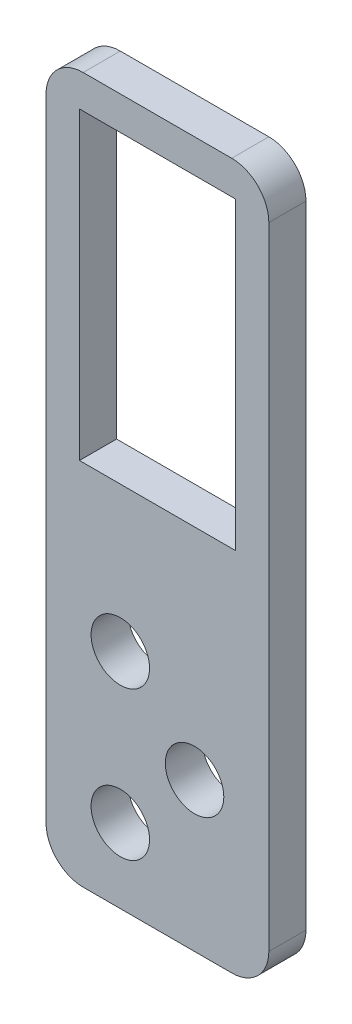
ISO-10303-21;
HEADER;
FILE_DESCRIPTION(('STEP AP214'),'2;1');
FILE_NAME('part.step','',(''),(''),'','','');
FILE_SCHEMA(('AUTOMOTIVE_DESIGN { 1 0 10303 214 1 1 1 1 }'));
ENDSEC;
DATA;
#1=APPLICATION_CONTEXT('core data for automotive mechanical design processes');
#2=APPLICATION_PROTOCOL_DEFINITION('international standard','automotive_design',2000,#1);
#3=PRODUCT_CONTEXT('',#1,'mechanical');
#4=PRODUCT('Part','Part','',(#3));
#5=PRODUCT_RELATED_PRODUCT_CATEGORY('part','',(#4));
#6=PRODUCT_DEFINITION_FORMATION('','',#4);
#7=PRODUCT_DEFINITION_CONTEXT('part definition',#1,'design');
#8=PRODUCT_DEFINITION('design','',#6,#7);
#9=PRODUCT_DEFINITION_SHAPE('','',#8);
#10=(LENGTH_UNIT() NAMED_UNIT(*) SI_UNIT(.MILLI.,.METRE.));
#11=(NAMED_UNIT(*) PLANE_ANGLE_UNIT() SI_UNIT($,.RADIAN.));
#12=(NAMED_UNIT(*) SI_UNIT($,.STERADIAN.) SOLID_ANGLE_UNIT());
#13=UNCERTAINTY_MEASURE_WITH_UNIT(LENGTH_MEASURE(1.E-05),#10,'distance_accuracy_value','');
#14=(GEOMETRIC_REPRESENTATION_CONTEXT(3) GLOBAL_UNCERTAINTY_ASSIGNED_CONTEXT((#13)) GLOBAL_UNIT_ASSIGNED_CONTEXT((#10,
#11,#12)) REPRESENTATION_CONTEXT('',''));
#15=CARTESIAN_POINT('',(0.,0.,0.));
#16=DIRECTION('',(0.,0.,1.));
#17=DIRECTION('',(1.,0.,0.));
#18=AXIS2_PLACEMENT_3D('',#15,#16,#17);
#19=CARTESIAN_POINT('',(0.,-57.7849999999999,6.35));
#20=DIRECTION('',(0.,-1.,0.));
#21=DIRECTION('',(0.,0.,-1.));
#22=AXIS2_PLACEMENT_3D('',#19,#20,#21);
#23=PLANE('',#22);
#24=DIRECTION('',(-1.,0.,0.));
#25=VECTOR('',#24,1.);
#26=CARTESIAN_POINT('',(0.,-57.7849999999999,0.));
#27=LINE('',#26,#25);
#28=CARTESIAN_POINT('',(32.3849999999998,-57.7849999999999,0.));
#29=VERTEX_POINT('',#28);
#30=CARTESIAN_POINT('',(5.71499999999979,-57.7849999999999,0.));
#31=VERTEX_POINT('',#30);
#32=EDGE_CURVE('E158',#29,#31,#27,.T.);
#33=ORIENTED_EDGE('',*,*,#32,.T.);
#34=DIRECTION('',(0.,0.,-1.));
#35=VECTOR('',#34,1.);
#36=CARTESIAN_POINT('',(5.71499999999979,-57.7849999999999,6.35));
#37=LINE('',#36,#35);
#38=CARTESIAN_POINT('',(5.71499999999979,-57.7849999999999,6.35));
#39=VERTEX_POINT('',#38);
#40=EDGE_CURVE('E138',#39,#31,#37,.T.);
#41=ORIENTED_EDGE('',*,*,#40,.F.);
#42=DIRECTION('',(-1.,0.,0.));
#43=VECTOR('',#42,1.);
#44=CARTESIAN_POINT('',(0.,-57.7849999999999,6.35));
#45=LINE('',#44,#43);
#46=CARTESIAN_POINT('',(32.3849999999998,-57.7849999999999,6.35));
#47=VERTEX_POINT('',#46);
#48=EDGE_CURVE('E146',#47,#39,#45,.T.);
#49=ORIENTED_EDGE('',*,*,#48,.F.);
#50=DIRECTION('',(0.,0.,-1.));
#51=VECTOR('',#50,1.);
#52=CARTESIAN_POINT('',(32.3849999999998,-57.7849999999999,6.35));
#53=LINE('',#52,#51);
#54=EDGE_CURVE('E276',#47,#29,#53,.T.);
#55=ORIENTED_EDGE('',*,*,#54,.T.);
#56=EDGE_LOOP('',(#33,#41,#49,#55));
#57=FACE_BOUND('',#56,.T.);
#58=ADVANCED_FACE('F41',(#57),#23,.F.);
#59=CARTESIAN_POINT('',(5.71499999999979,0.,6.35));
#60=DIRECTION('',(-1.,0.,0.));
#61=DIRECTION('',(0.,0.,1.));
#62=AXIS2_PLACEMENT_3D('',#59,#60,#61);
#63=PLANE('',#62);
#64=DIRECTION('',(0.,1.,0.));
#65=VECTOR('',#64,1.);
#66=CARTESIAN_POINT('',(5.71499999999979,0.,0.));
#67=LINE('',#66,#65);
#68=CARTESIAN_POINT('',(5.71499999999979,-5.71499999999994,0.));
#69=VERTEX_POINT('',#68);
#70=EDGE_CURVE('E266',#31,#69,#67,.T.);
#71=ORIENTED_EDGE('',*,*,#70,.T.);
#72=DIRECTION('',(0.,0.,-1.));
#73=VECTOR('',#72,1.);
#74=CARTESIAN_POINT('',(5.71499999999979,-5.71499999999994,6.35));
#75=LINE('',#74,#73);
#76=CARTESIAN_POINT('',(5.71499999999979,-5.71499999999994,6.35));
#77=VERTEX_POINT('',#76);
#78=EDGE_CURVE('E140',#77,#69,#75,.T.);
#79=ORIENTED_EDGE('',*,*,#78,.F.);
#80=DIRECTION('',(0.,1.,0.));
#81=VECTOR('',#80,1.);
#82=CARTESIAN_POINT('',(5.71499999999979,0.,6.35));
#83=LINE('',#82,#81);
#84=EDGE_CURVE('E133',#39,#77,#83,.T.);
#85=ORIENTED_EDGE('',*,*,#84,.F.);
#86=ORIENTED_EDGE('',*,*,#40,.T.);
#87=EDGE_LOOP('',(#71,#79,#85,#86));
#88=FACE_BOUND('',#87,.T.);
#89=ADVANCED_FACE('F136',(#88),#63,.F.);
#90=CARTESIAN_POINT('',(0.,-5.71499999999994,6.35));
#91=DIRECTION('',(0.,-1.,0.));
#92=DIRECTION('',(1.,0.,0.));
#93=AXIS2_PLACEMENT_3D('',#90,#91,#92);
#94=PLANE('',#93);
#95=DIRECTION('',(-1.,0.,0.));
#96=VECTOR('',#95,1.);
#97=CARTESIAN_POINT('',(0.,-5.71499999999994,0.));
#98=LINE('',#97,#96);
#99=CARTESIAN_POINT('',(32.3849999999998,-5.71499999999994,0.));
#100=VERTEX_POINT('',#99);
#101=EDGE_CURVE('E269',#100,#69,#98,.T.);
#102=ORIENTED_EDGE('',*,*,#101,.F.);
#103=DIRECTION('',(0.,0.,-1.));
#104=VECTOR('',#103,1.);
#105=CARTESIAN_POINT('',(32.3849999999998,-5.71499999999994,6.35));
#106=LINE('',#105,#104);
#107=CARTESIAN_POINT('',(32.3849999999998,-5.71499999999994,6.35));
#108=VERTEX_POINT('',#107);
#109=EDGE_CURVE('E166',#108,#100,#106,.T.);
#110=ORIENTED_EDGE('',*,*,#109,.F.);
#111=DIRECTION('',(-1.,0.,0.));
#112=VECTOR('',#111,1.);
#113=CARTESIAN_POINT('',(0.,-5.71499999999994,6.35));
#114=LINE('',#113,#112);
#115=EDGE_CURVE('E145',#108,#77,#114,.T.);
#116=ORIENTED_EDGE('',*,*,#115,.T.);
#117=ORIENTED_EDGE('',*,*,#78,.T.);
#118=EDGE_LOOP('',(#102,#110,#116,#117));
#119=FACE_BOUND('',#118,.T.);
#120=ADVANCED_FACE('F284',(#119),#94,.T.);
#121=CARTESIAN_POINT('',(0.,-120.671250194844,6.35));
#122=DIRECTION('',(0.,1.,0.));
#123=DIRECTION('',(0.,0.,1.));
#124=AXIS2_PLACEMENT_3D('',#121,#122,#123);
#125=PLANE('',#124);
#126=DIRECTION('',(1.,0.,0.));
#127=VECTOR('',#126,1.);
#128=CARTESIAN_POINT('',(0.,-120.671250194844,6.35));
#129=LINE('',#128,#127);
#130=CARTESIAN_POINT('',(6.35000000000001,-120.671250194844,6.35));
#131=VERTEX_POINT('',#130);
#132=CARTESIAN_POINT('',(31.7499999999996,-120.671250194844,6.35));
#133=VERTEX_POINT('',#132);
#134=EDGE_CURVE('E215',#131,#133,#129,.T.);
#135=ORIENTED_EDGE('',*,*,#134,.F.);
#136=DIRECTION('',(0.,0.,-1.));
#137=VECTOR('',#136,1.);
#138=CARTESIAN_POINT('',(6.35000000000001,-120.671250194844,6.35));
#139=LINE('',#138,#137);
#140=CARTESIAN_POINT('',(6.35000000000001,-120.671250194844,0.));
#141=VERTEX_POINT('',#140);
#142=EDGE_CURVE('E11',#131,#141,#139,.T.);
#143=ORIENTED_EDGE('',*,*,#142,.T.);
#144=DIRECTION('',(1.,0.,0.));
#145=VECTOR('',#144,1.);
#146=CARTESIAN_POINT('',(0.,-120.671250194844,0.));
#147=LINE('',#146,#145);
#148=CARTESIAN_POINT('',(31.7499999999996,-120.671250194844,0.));
#149=VERTEX_POINT('',#148);
#150=EDGE_CURVE('E218',#141,#149,#147,.T.);
#151=ORIENTED_EDGE('',*,*,#150,.T.);
#152=DIRECTION('',(0.,0.,-1.));
#153=VECTOR('',#152,1.);
#154=CARTESIAN_POINT('',(31.7499999999996,-120.671250194844,6.35));
#155=LINE('',#154,#153);
#156=EDGE_CURVE('E50',#149,#133,#155,.F.);
#157=ORIENTED_EDGE('',*,*,#156,.T.);
#158=EDGE_LOOP('',(#135,#143,#151,#157));
#159=FACE_BOUND('',#158,.T.);
#160=ADVANCED_FACE('F214',(#159),#125,.F.);
#161=CARTESIAN_POINT('',(38.0999999999996,0.,6.35));
#162=DIRECTION('',(1.,0.,0.));
#163=DIRECTION('',(0.,1.,0.));
#164=AXIS2_PLACEMENT_3D('',#161,#162,#163);
#165=PLANE('',#164);
#166=DIRECTION('',(0.,-1.,0.));
#167=VECTOR('',#166,1.);
#168=CARTESIAN_POINT('',(38.0999999999996,0.,0.));
#169=LINE('',#168,#167);
#170=CARTESIAN_POINT('',(38.0999999999996,-6.35,0.));
#171=VERTEX_POINT('',#170);
#172=CARTESIAN_POINT('',(38.0999999999996,-114.321250194844,0.));
#173=VERTEX_POINT('',#172);
#174=EDGE_CURVE('E234',#171,#173,#169,.T.);
#175=ORIENTED_EDGE('',*,*,#174,.F.);
#176=DIRECTION('',(0.,0.,-1.));
#177=VECTOR('',#176,1.);
#178=CARTESIAN_POINT('',(38.0999999999996,-6.35,6.35));
#179=LINE('',#178,#177);
#180=CARTESIAN_POINT('',(38.0999999999996,-6.35,6.35));
#181=VERTEX_POINT('',#180);
#182=EDGE_CURVE('E189',#171,#181,#179,.F.);
#183=ORIENTED_EDGE('',*,*,#182,.T.);
#184=DIRECTION('',(0.,-1.,0.));
#185=VECTOR('',#184,1.);
#186=CARTESIAN_POINT('',(38.0999999999996,0.,6.35));
#187=LINE('',#186,#185);
#188=CARTESIAN_POINT('',(38.0999999999996,-114.321250194844,6.35));
#189=VERTEX_POINT('',#188);
#190=EDGE_CURVE('E226',#181,#189,#187,.T.);
#191=ORIENTED_EDGE('',*,*,#190,.T.);
#192=DIRECTION('',(0.,0.,-1.));
#193=VECTOR('',#192,1.);
#194=CARTESIAN_POINT('',(38.0999999999996,-114.321250194844,0.));
#195=LINE('',#194,#193);
#196=EDGE_CURVE('E185',#189,#173,#195,.T.);
#197=ORIENTED_EDGE('',*,*,#196,.T.);
#198=EDGE_LOOP('',(#175,#183,#191,#197));
#199=FACE_BOUND('',#198,.T.);
#200=ADVANCED_FACE('F233',(#199),#165,.T.);
#201=CARTESIAN_POINT('',(0.,0.,6.35));
#202=DIRECTION('',(0.,1.,0.));
#203=DIRECTION('',(0.,0.,1.));
#204=AXIS2_PLACEMENT_3D('',#201,#202,#203);
#205=PLANE('',#204);
#206=DIRECTION('',(1.,0.,0.));
#207=VECTOR('',#206,1.);
#208=CARTESIAN_POINT('',(0.,0.,6.35));
#209=LINE('',#208,#207);
#210=CARTESIAN_POINT('',(6.35,0.,6.35));
#211=VERTEX_POINT('',#210);
#212=CARTESIAN_POINT('',(31.7499999999996,0.,6.35));
#213=VERTEX_POINT('',#212);
#214=EDGE_CURVE('E344',#211,#213,#209,.T.);
#215=ORIENTED_EDGE('',*,*,#214,.T.);
#216=DIRECTION('',(0.,0.,-1.));
#217=VECTOR('',#216,1.);
#218=CARTESIAN_POINT('',(31.7499999999996,0.,6.35));
#219=LINE('',#218,#217);
#220=CARTESIAN_POINT('',(31.7499999999996,0.,0.));
#221=VERTEX_POINT('',#220);
#222=EDGE_CURVE('E164',#213,#221,#219,.T.);
#223=ORIENTED_EDGE('',*,*,#222,.T.);
#224=DIRECTION('',(1.,0.,0.));
#225=VECTOR('',#224,1.);
#226=CARTESIAN_POINT('',(0.,0.,0.));
#227=LINE('',#226,#225);
#228=CARTESIAN_POINT('',(6.35,0.,0.));
#229=VERTEX_POINT('',#228);
#230=EDGE_CURVE('E241',#229,#221,#227,.T.);
#231=ORIENTED_EDGE('',*,*,#230,.F.);
#232=DIRECTION('',(0.,0.,-1.));
#233=VECTOR('',#232,1.);
#234=CARTESIAN_POINT('',(6.35,0.,6.35));
#235=LINE('',#234,#233);
#236=EDGE_CURVE('E160',#229,#211,#235,.F.);
#237=ORIENTED_EDGE('',*,*,#236,.T.);
#238=EDGE_LOOP('',(#215,#223,#231,#237));
#239=FACE_BOUND('',#238,.T.);
#240=ADVANCED_FACE('F310',(#239),#205,.T.);
#241=CARTESIAN_POINT('',(12.6999999999993,-107.971250194844,6.35));
#242=DIRECTION('',(0.,0.,-1.));
#243=DIRECTION('',(-1.,0.,0.));
#244=AXIS2_PLACEMENT_3D('',#241,#242,#243);
#245=CYLINDRICAL_SURFACE('',#244,4.99999999999979);
#246=CARTESIAN_POINT('',(12.6999999999993,-107.971250194844,6.35));
#247=DIRECTION('',(0.,0.,1.));
#248=DIRECTION('',(1.,0.,0.));
#249=AXIS2_PLACEMENT_3D('',#246,#247,#248);
#250=CIRCLE('',#249,4.99999999999979);
#251=CARTESIAN_POINT('',(17.6999999999991,-107.971250194844,6.35));
#252=VERTEX_POINT('',#251);
#253=EDGE_CURVE('E155',#252,#252,#250,.T.);
#254=ORIENTED_EDGE('',*,*,#253,.T.);
#255=EDGE_LOOP('',(#254));
#256=FACE_BOUND('',#255,.T.);
#257=CARTESIAN_POINT('',(12.6999999999993,-107.971250194844,0.));
#258=DIRECTION('',(0.,0.,1.));
#259=DIRECTION('',(1.,0.,0.));
#260=AXIS2_PLACEMENT_3D('',#257,#258,#259);
#261=CIRCLE('',#260,4.99999999999979);
#262=CARTESIAN_POINT('',(17.6999999999991,-107.971250194844,0.));
#263=VERTEX_POINT('',#262);
#264=EDGE_CURVE('E260',#263,#263,#261,.T.);
#265=ORIENTED_EDGE('',*,*,#264,.F.);
#266=EDGE_LOOP('',(#265));
#267=FACE_BOUND('',#266,.T.);
#268=ADVANCED_FACE('F306',(#256,#267),#245,.F.);
#269=CARTESIAN_POINT('',(12.6999999999993,-82.5712501948437,6.35));
#270=DIRECTION('',(0.,0.,-1.));
#271=DIRECTION('',(-1.,0.,0.));
#272=AXIS2_PLACEMENT_3D('',#269,#270,#271);
#273=CYLINDRICAL_SURFACE('',#272,4.99999999999979);
#274=CARTESIAN_POINT('',(12.6999999999993,-82.5712501948437,6.35));
#275=DIRECTION('',(0.,0.,1.));
#276=DIRECTION('',(1.,0.,0.));
#277=AXIS2_PLACEMENT_3D('',#274,#275,#276);
#278=CIRCLE('',#277,4.99999999999979);
#279=CARTESIAN_POINT('',(17.6999999999991,-82.5712501948437,6.35));
#280=VERTEX_POINT('',#279);
#281=EDGE_CURVE('E357',#280,#280,#278,.T.);
#282=ORIENTED_EDGE('',*,*,#281,.T.);
#283=EDGE_LOOP('',(#282));
#284=FACE_BOUND('',#283,.T.);
#285=CARTESIAN_POINT('',(12.6999999999993,-82.5712501948437,0.));
#286=DIRECTION('',(0.,0.,1.));
#287=DIRECTION('',(1.,0.,0.));
#288=AXIS2_PLACEMENT_3D('',#285,#286,#287);
#289=CIRCLE('',#288,4.99999999999979);
#290=CARTESIAN_POINT('',(17.6999999999991,-82.5712501948437,0.));
#291=VERTEX_POINT('',#290);
#292=EDGE_CURVE('E256',#291,#291,#289,.T.);
#293=ORIENTED_EDGE('',*,*,#292,.F.);
#294=EDGE_LOOP('',(#293));
#295=FACE_BOUND('',#294,.T.);
#296=ADVANCED_FACE('F309',(#284,#295),#273,.F.);
#297=CARTESIAN_POINT('',(25.3999999999994,-95.2712501948438,6.35));
#298=DIRECTION('',(0.,0.,-1.));
#299=DIRECTION('',(-1.,0.,0.));
#300=AXIS2_PLACEMENT_3D('',#297,#298,#299);
#301=CYLINDRICAL_SURFACE('',#300,4.99999999999978);
#302=CARTESIAN_POINT('',(25.3999999999994,-95.2712501948438,6.35));
#303=DIRECTION('',(0.,0.,1.));
#304=DIRECTION('',(1.,0.,0.));
#305=AXIS2_PLACEMENT_3D('',#302,#303,#304);
#306=CIRCLE('',#305,4.99999999999978);
#307=CARTESIAN_POINT('',(30.3999999999992,-95.2712501948438,6.35));
#308=VERTEX_POINT('',#307);
#309=EDGE_CURVE('E353',#308,#308,#306,.T.);
#310=ORIENTED_EDGE('',*,*,#309,.T.);
#311=EDGE_LOOP('',(#310));
#312=FACE_BOUND('',#311,.T.);
#313=CARTESIAN_POINT('',(25.3999999999994,-95.2712501948438,0.));
#314=DIRECTION('',(0.,0.,1.));
#315=DIRECTION('',(1.,0.,0.));
#316=AXIS2_PLACEMENT_3D('',#313,#314,#315);
#317=CIRCLE('',#316,4.99999999999978);
#318=CARTESIAN_POINT('',(30.3999999999992,-95.2712501948438,0.));
#319=VERTEX_POINT('',#318);
#320=EDGE_CURVE('E252',#319,#319,#317,.T.);
#321=ORIENTED_EDGE('',*,*,#320,.F.);
#322=EDGE_LOOP('',(#321));
#323=FACE_BOUND('',#322,.T.);
#324=ADVANCED_FACE('F314',(#312,#323),#301,.F.);
#325=CARTESIAN_POINT('',(0.,0.,6.35));
#326=DIRECTION('',(1.,0.,0.));
#327=DIRECTION('',(0.,1.,0.));
#328=AXIS2_PLACEMENT_3D('',#325,#326,#327);
#329=PLANE('',#328);
#330=DIRECTION('',(0.,-1.,0.));
#331=VECTOR('',#330,1.);
#332=CARTESIAN_POINT('',(0.,0.,6.35));
#333=LINE('',#332,#331);
#334=CARTESIAN_POINT('',(0.,-6.35,6.35));
#335=VERTEX_POINT('',#334);
#336=CARTESIAN_POINT('',(0.,-114.321250194844,6.35));
#337=VERTEX_POINT('',#336);
#338=EDGE_CURVE('E339',#335,#337,#333,.T.);
#339=ORIENTED_EDGE('',*,*,#338,.F.);
#340=DIRECTION('',(0.,0.,-1.));
#341=VECTOR('',#340,1.);
#342=CARTESIAN_POINT('',(0.,-6.35,0.));
#343=LINE('',#342,#341);
#344=CARTESIAN_POINT('',(0.,-6.35,0.));
#345=VERTEX_POINT('',#344);
#346=EDGE_CURVE('E205',#335,#345,#343,.T.);
#347=ORIENTED_EDGE('',*,*,#346,.T.);
#348=DIRECTION('',(0.,-1.,0.));
#349=VECTOR('',#348,1.);
#350=CARTESIAN_POINT('',(0.,0.,0.));
#351=LINE('',#350,#349);
#352=CARTESIAN_POINT('',(0.,-114.321250194844,0.));
#353=VERTEX_POINT('',#352);
#354=EDGE_CURVE('E245',#345,#353,#351,.T.);
#355=ORIENTED_EDGE('',*,*,#354,.T.);
#356=DIRECTION('',(0.,0.,-1.));
#357=VECTOR('',#356,1.);
#358=CARTESIAN_POINT('',(0.,-114.321250194844,6.35));
#359=LINE('',#358,#357);
#360=EDGE_CURVE('E57',#353,#337,#359,.F.);
#361=ORIENTED_EDGE('',*,*,#360,.T.);
#362=EDGE_LOOP('',(#339,#347,#355,#361));
#363=FACE_BOUND('',#362,.T.);
#364=ADVANCED_FACE('F318',(#363),#329,.F.);
#365=CARTESIAN_POINT('',(32.3849999999998,0.,6.35));
#366=DIRECTION('',(-1.,0.,0.));
#367=DIRECTION('',(0.,0.,1.));
#368=AXIS2_PLACEMENT_3D('',#365,#366,#367);
#369=PLANE('',#368);
#370=DIRECTION('',(0.,1.,0.));
#371=VECTOR('',#370,1.);
#372=CARTESIAN_POINT('',(32.3849999999998,0.,0.));
#373=LINE('',#372,#371);
#374=EDGE_CURVE('E227',#29,#100,#373,.T.);
#375=ORIENTED_EDGE('',*,*,#374,.F.);
#376=ORIENTED_EDGE('',*,*,#54,.F.);
#377=DIRECTION('',(0.,1.,0.));
#378=VECTOR('',#377,1.);
#379=CARTESIAN_POINT('',(32.3849999999998,0.,6.35));
#380=LINE('',#379,#378);
#381=EDGE_CURVE('E152',#47,#108,#380,.T.);
#382=ORIENTED_EDGE('',*,*,#381,.T.);
#383=ORIENTED_EDGE('',*,*,#109,.T.);
#384=EDGE_LOOP('',(#375,#376,#382,#383));
#385=FACE_BOUND('',#384,.T.);
#386=ADVANCED_FACE('F282',(#385),#369,.T.);
#387=CARTESIAN_POINT('',(0.,0.,6.35));
#388=DIRECTION('',(0.,0.,1.));
#389=DIRECTION('',(1.,0.,0.));
#390=AXIS2_PLACEMENT_3D('',#387,#388,#389);
#391=PLANE('',#390);
#392=ORIENTED_EDGE('',*,*,#190,.F.);
#393=CARTESIAN_POINT('',(31.7499999999996,-6.35,6.35));
#394=DIRECTION('',(0.,0.,1.));
#395=DIRECTION('',(1.,0.,0.));
#396=AXIS2_PLACEMENT_3D('',#393,#394,#395);
#397=CIRCLE('',#396,6.35);
#398=EDGE_CURVE('E200',#181,#213,#397,.T.);
#399=ORIENTED_EDGE('',*,*,#398,.T.);
#400=ORIENTED_EDGE('',*,*,#214,.F.);
#401=CARTESIAN_POINT('',(6.35,-6.35,6.35));
#402=DIRECTION('',(0.,0.,1.));
#403=DIRECTION('',(1.,0.,0.));
#404=AXIS2_PLACEMENT_3D('',#401,#402,#403);
#405=CIRCLE('',#404,6.35);
#406=EDGE_CURVE('E64',#211,#335,#405,.T.);
#407=ORIENTED_EDGE('',*,*,#406,.T.);
#408=ORIENTED_EDGE('',*,*,#338,.T.);
#409=CARTESIAN_POINT('',(6.35000000000001,-114.321250194844,6.35));
#410=DIRECTION('',(0.,0.,1.));
#411=DIRECTION('',(1.,0.,0.));
#412=AXIS2_PLACEMENT_3D('',#409,#410,#411);
#413=CIRCLE('',#412,6.35);
#414=EDGE_CURVE('E195',#337,#131,#413,.T.);
#415=ORIENTED_EDGE('',*,*,#414,.T.);
#416=ORIENTED_EDGE('',*,*,#134,.T.);
#417=CARTESIAN_POINT('',(31.7499999999996,-114.321250194844,6.35));
#418=DIRECTION('',(0.,0.,1.));
#419=DIRECTION('',(1.,0.,0.));
#420=AXIS2_PLACEMENT_3D('',#417,#418,#419);
#421=CIRCLE('',#420,6.35);
#422=EDGE_CURVE('E192',#133,#189,#421,.T.);
#423=ORIENTED_EDGE('',*,*,#422,.T.);
#424=EDGE_LOOP('',(#392,#399,#400,#407,#408,#415,#416,#423));
#425=FACE_BOUND('',#424,.T.);
#426=ORIENTED_EDGE('',*,*,#309,.F.);
#427=EDGE_LOOP('',(#426));
#428=FACE_BOUND('',#427,.T.);
#429=ORIENTED_EDGE('',*,*,#281,.F.);
#430=EDGE_LOOP('',(#429));
#431=FACE_BOUND('',#430,.T.);
#432=ORIENTED_EDGE('',*,*,#253,.F.);
#433=EDGE_LOOP('',(#432));
#434=FACE_BOUND('',#433,.T.);
#435=ORIENTED_EDGE('',*,*,#48,.T.);
#436=ORIENTED_EDGE('',*,*,#84,.T.);
#437=ORIENTED_EDGE('',*,*,#115,.F.);
#438=ORIENTED_EDGE('',*,*,#381,.F.);
#439=EDGE_LOOP('',(#435,#436,#437,#438));
#440=FACE_BOUND('',#439,.T.);
#441=ADVANCED_FACE('F150',(#425,#428,#431,#434,#440),#391,.T.);
#442=CARTESIAN_POINT('',(0.,0.,0.));
#443=DIRECTION('',(0.,0.,1.));
#444=DIRECTION('',(1.,0.,0.));
#445=AXIS2_PLACEMENT_3D('',#442,#443,#444);
#446=PLANE('',#445);
#447=ORIENTED_EDGE('',*,*,#230,.T.);
#448=CARTESIAN_POINT('',(31.7499999999996,-6.35,0.));
#449=DIRECTION('',(0.,0.,1.));
#450=DIRECTION('',(1.,0.,0.));
#451=AXIS2_PLACEMENT_3D('',#448,#449,#450);
#452=CIRCLE('',#451,6.35);
#453=EDGE_CURVE('E182',#221,#171,#452,.F.);
#454=ORIENTED_EDGE('',*,*,#453,.T.);
#455=ORIENTED_EDGE('',*,*,#174,.T.);
#456=CARTESIAN_POINT('',(31.7499999999996,-114.321250194844,0.));
#457=DIRECTION('',(0.,0.,1.));
#458=DIRECTION('',(1.,0.,0.));
#459=AXIS2_PLACEMENT_3D('',#456,#457,#458);
#460=CIRCLE('',#459,6.35);
#461=EDGE_CURVE('E173',#173,#149,#460,.F.);
#462=ORIENTED_EDGE('',*,*,#461,.T.);
#463=ORIENTED_EDGE('',*,*,#150,.F.);
#464=CARTESIAN_POINT('',(6.35000000000001,-114.321250194844,0.));
#465=DIRECTION('',(0.,0.,1.));
#466=DIRECTION('',(1.,0.,0.));
#467=AXIS2_PLACEMENT_3D('',#464,#465,#466);
#468=CIRCLE('',#467,6.35);
#469=EDGE_CURVE('E176',#141,#353,#468,.F.);
#470=ORIENTED_EDGE('',*,*,#469,.T.);
#471=ORIENTED_EDGE('',*,*,#354,.F.);
#472=CARTESIAN_POINT('',(6.35,-6.35,0.));
#473=DIRECTION('',(0.,0.,1.));
#474=DIRECTION('',(1.,0.,0.));
#475=AXIS2_PLACEMENT_3D('',#472,#473,#474);
#476=CIRCLE('',#475,6.35);
#477=EDGE_CURVE('E179',#345,#229,#476,.F.);
#478=ORIENTED_EDGE('',*,*,#477,.T.);
#479=EDGE_LOOP('',(#447,#454,#455,#462,#463,#470,#471,#478));
#480=FACE_BOUND('',#479,.T.);
#481=ORIENTED_EDGE('',*,*,#320,.T.);
#482=EDGE_LOOP('',(#481));
#483=FACE_BOUND('',#482,.T.);
#484=ORIENTED_EDGE('',*,*,#292,.T.);
#485=EDGE_LOOP('',(#484));
#486=FACE_BOUND('',#485,.T.);
#487=ORIENTED_EDGE('',*,*,#264,.T.);
#488=EDGE_LOOP('',(#487));
#489=FACE_BOUND('',#488,.T.);
#490=ORIENTED_EDGE('',*,*,#32,.F.);
#491=ORIENTED_EDGE('',*,*,#374,.T.);
#492=ORIENTED_EDGE('',*,*,#101,.T.);
#493=ORIENTED_EDGE('',*,*,#70,.F.);
#494=EDGE_LOOP('',(#490,#491,#492,#493));
#495=FACE_BOUND('',#494,.T.);
#496=ADVANCED_FACE('F238',(#480,#483,#486,#489,#495),#446,.F.);
#497=CARTESIAN_POINT('',(31.7499999999996,-6.35,6.35));
#498=DIRECTION('',(0.,0.,-1.));
#499=DIRECTION('',(-1.,0.,0.));
#500=AXIS2_PLACEMENT_3D('',#497,#498,#499);
#501=CYLINDRICAL_SURFACE('',#500,6.35);
#502=ORIENTED_EDGE('',*,*,#398,.F.);
#503=ORIENTED_EDGE('',*,*,#182,.F.);
#504=ORIENTED_EDGE('',*,*,#453,.F.);
#505=ORIENTED_EDGE('',*,*,#222,.F.);
#506=EDGE_LOOP('',(#502,#503,#504,#505));
#507=FACE_BOUND('',#506,.T.);
#508=ADVANCED_FACE('F287',(#507),#501,.T.);
#509=CARTESIAN_POINT('',(6.35,-6.35,6.35));
#510=DIRECTION('',(0.,0.,1.));
#511=DIRECTION('',(1.,0.,0.));
#512=AXIS2_PLACEMENT_3D('',#509,#510,#511);
#513=CYLINDRICAL_SURFACE('',#512,6.35);
#514=ORIENTED_EDGE('',*,*,#406,.F.);
#515=ORIENTED_EDGE('',*,*,#236,.F.);
#516=ORIENTED_EDGE('',*,*,#477,.F.);
#517=ORIENTED_EDGE('',*,*,#346,.F.);
#518=EDGE_LOOP('',(#514,#515,#516,#517));
#519=FACE_BOUND('',#518,.T.);
#520=ADVANCED_FACE('F293',(#519),#513,.T.);
#521=CARTESIAN_POINT('',(6.35000000000001,-114.321250194844,6.35));
#522=DIRECTION('',(0.,0.,-1.));
#523=DIRECTION('',(-1.,0.,0.));
#524=AXIS2_PLACEMENT_3D('',#521,#522,#523);
#525=CYLINDRICAL_SURFACE('',#524,6.35);
#526=ORIENTED_EDGE('',*,*,#414,.F.);
#527=ORIENTED_EDGE('',*,*,#360,.F.);
#528=ORIENTED_EDGE('',*,*,#469,.F.);
#529=ORIENTED_EDGE('',*,*,#142,.F.);
#530=EDGE_LOOP('',(#526,#527,#528,#529));
#531=FACE_BOUND('',#530,.T.);
#532=ADVANCED_FACE('F330',(#531),#525,.T.);
#533=CARTESIAN_POINT('',(31.7499999999996,-114.321250194844,6.35));
#534=DIRECTION('',(0.,0.,1.));
#535=DIRECTION('',(1.,0.,0.));
#536=AXIS2_PLACEMENT_3D('',#533,#534,#535);
#537=CYLINDRICAL_SURFACE('',#536,6.35);
#538=ORIENTED_EDGE('',*,*,#422,.F.);
#539=ORIENTED_EDGE('',*,*,#156,.F.);
#540=ORIENTED_EDGE('',*,*,#461,.F.);
#541=ORIENTED_EDGE('',*,*,#196,.F.);
#542=EDGE_LOOP('',(#538,#539,#540,#541));
#543=FACE_BOUND('',#542,.T.);
#544=ADVANCED_FACE('F43',(#543),#537,.T.);
#545=CLOSED_SHELL('',(#58,#89,#120,#160,#200,#240,#268,#296,#324,#364,#386,#441,#496,#508,#520,
#532,#544));
#546=MANIFOLD_SOLID_BREP('B2',#545);
#547=ADVANCED_BREP_SHAPE_REPRESENTATION('',(#18,#546),#14);
#548=SHAPE_DEFINITION_REPRESENTATION(#9,#547);
ENDSEC;
END-ISO-10303-21;
